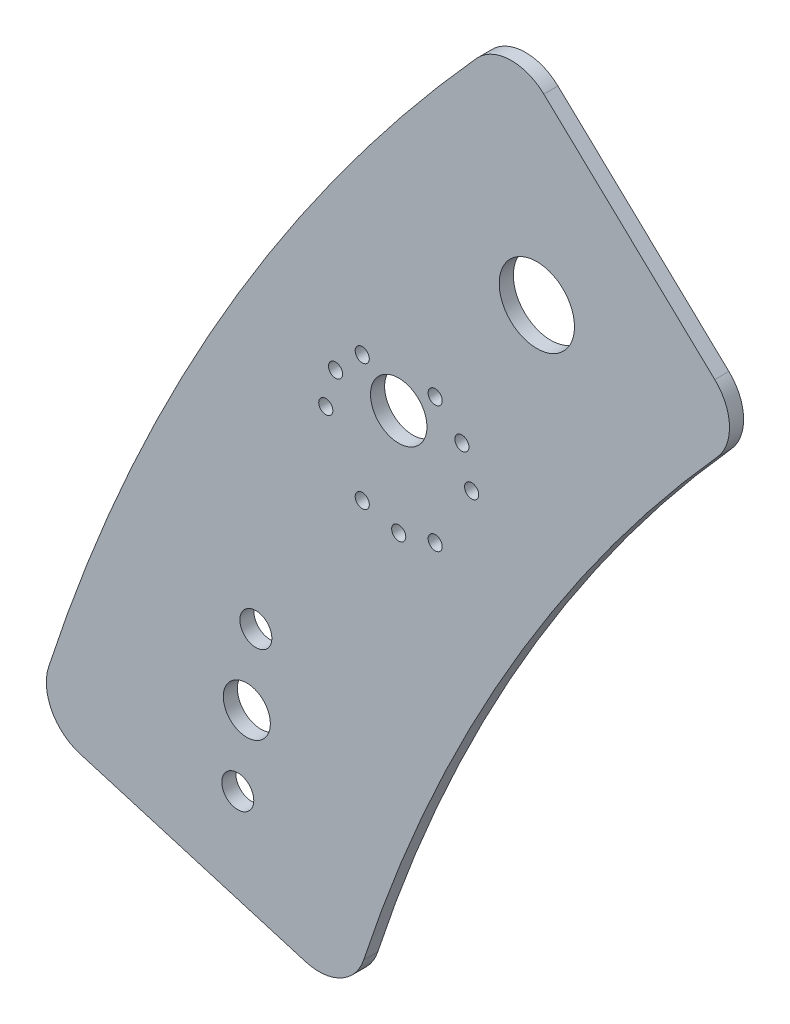
ISO-10303-21;
HEADER;
FILE_DESCRIPTION(('STEP AP214'),'2;1');
FILE_NAME('part.step','',(''),(''),'','','');
FILE_SCHEMA(('AUTOMOTIVE_DESIGN { 1 0 10303 214 1 1 1 1 }'));
ENDSEC;
DATA;
#1=APPLICATION_CONTEXT('core data for automotive mechanical design processes');
#2=APPLICATION_PROTOCOL_DEFINITION('international standard','automotive_design',2000,#1);
#3=PRODUCT_CONTEXT('',#1,'mechanical');
#4=PRODUCT('Part','Part','',(#3));
#5=PRODUCT_RELATED_PRODUCT_CATEGORY('part','',(#4));
#6=PRODUCT_DEFINITION_FORMATION('','',#4);
#7=PRODUCT_DEFINITION_CONTEXT('part definition',#1,'design');
#8=PRODUCT_DEFINITION('design','',#6,#7);
#9=PRODUCT_DEFINITION_SHAPE('','',#8);
#10=(LENGTH_UNIT() NAMED_UNIT(*) SI_UNIT(.MILLI.,.METRE.));
#11=(NAMED_UNIT(*) PLANE_ANGLE_UNIT() SI_UNIT($,.RADIAN.));
#12=(NAMED_UNIT(*) SI_UNIT($,.STERADIAN.) SOLID_ANGLE_UNIT());
#13=UNCERTAINTY_MEASURE_WITH_UNIT(LENGTH_MEASURE(1.E-05),#10,'distance_accuracy_value','');
#14=(GEOMETRIC_REPRESENTATION_CONTEXT(3) GLOBAL_UNCERTAINTY_ASSIGNED_CONTEXT((#13)) GLOBAL_UNIT_ASSIGNED_CONTEXT((#10,
#11,#12)) REPRESENTATION_CONTEXT('',''));
#15=CARTESIAN_POINT('',(0.,0.,0.));
#16=DIRECTION('',(0.,0.,1.));
#17=DIRECTION('',(1.,0.,0.));
#18=AXIS2_PLACEMENT_3D('',#15,#16,#17);
#19=CARTESIAN_POINT('',(-356.499858507935,116.702482734826,3.));
#20=DIRECTION('',(0.,0.,1.));
#21=DIRECTION('',(1.,0.,0.));
#22=AXIS2_PLACEMENT_3D('',#19,#20,#21);
#23=PLANE('',#22);
#24=CARTESIAN_POINT('',(-331.793705934377,198.005251084754,3.));
#25=DIRECTION('',(0.,0.,1.));
#26=DIRECTION('',(0.50000000000001,-0.866025403784433,0.));
#27=AXIS2_PLACEMENT_3D('',#24,#25,#26);
#28=CIRCLE('',#27,1.49999999999996);
#29=CARTESIAN_POINT('',(-331.043705934377,196.706212979078,3.));
#30=VERTEX_POINT('',#29);
#31=EDGE_CURVE('E493',#30,#30,#28,.T.);
#32=ORIENTED_EDGE('',*,*,#31,.F.);
#33=EDGE_LOOP('',(#32));
#34=FACE_BOUND('',#33,.T.);
#35=CARTESIAN_POINT('',(-347.293705934415,198.005251084752,3.));
#36=DIRECTION('',(0.,0.,1.));
#37=DIRECTION('',(-0.499999999999992,-0.866025403784443,0.));
#38=AXIS2_PLACEMENT_3D('',#35,#36,#37);
#39=CIRCLE('',#38,1.49999999999996);
#40=CARTESIAN_POINT('',(-348.043705934415,196.706212979076,3.));
#41=VERTEX_POINT('',#40);
#42=EDGE_CURVE('E492',#41,#41,#39,.T.);
#43=ORIENTED_EDGE('',*,*,#42,.F.);
#44=EDGE_LOOP('',(#43));
#45=FACE_BOUND('',#44,.T.);
#46=CARTESIAN_POINT('',(-355.043705934435,211.428644843443,3.));
#47=DIRECTION('',(0.,0.,1.));
#48=DIRECTION('',(-1.,0.,0.));
#49=AXIS2_PLACEMENT_3D('',#46,#47,#48);
#50=CIRCLE('',#49,1.49999999999996);
#51=CARTESIAN_POINT('',(-356.543705934435,211.428644843443,3.));
#52=VERTEX_POINT('',#51);
#53=EDGE_CURVE('E499',#52,#52,#50,.T.);
#54=ORIENTED_EDGE('',*,*,#53,.F.);
#55=EDGE_LOOP('',(#54));
#56=FACE_BOUND('',#55,.T.);
#57=CARTESIAN_POINT('',(-347.293705934418,224.852038602135,3.));
#58=DIRECTION('',(0.,0.,1.));
#59=DIRECTION('',(-0.500000000000004,0.866025403784436,0.));
#60=AXIS2_PLACEMENT_3D('',#57,#58,#59);
#61=CIRCLE('',#60,1.49999999999996);
#62=CARTESIAN_POINT('',(-348.043705934418,226.151076707812,3.));
#63=VERTEX_POINT('',#62);
#64=EDGE_CURVE('E505',#63,#63,#61,.T.);
#65=ORIENTED_EDGE('',*,*,#64,.F.);
#66=EDGE_LOOP('',(#65));
#67=FACE_BOUND('',#66,.T.);
#68=CARTESIAN_POINT('',(-331.79370593438,224.852038602137,3.));
#69=DIRECTION('',(0.,0.,1.));
#70=DIRECTION('',(0.499999999999998,0.86602540378444,0.));
#71=AXIS2_PLACEMENT_3D('',#68,#69,#70);
#72=CIRCLE('',#71,1.49999999999996);
#73=CARTESIAN_POINT('',(-331.04370593438,226.151076707814,3.));
#74=VERTEX_POINT('',#73);
#75=EDGE_CURVE('E485',#74,#74,#72,.T.);
#76=ORIENTED_EDGE('',*,*,#75,.F.);
#77=EDGE_LOOP('',(#76));
#78=FACE_BOUND('',#77,.T.);
#79=CARTESIAN_POINT('',(-324.04370593436,211.428644843447,3.));
#80=DIRECTION('',(0.,0.,1.));
#81=DIRECTION('',(1.,0.,0.));
#82=AXIS2_PLACEMENT_3D('',#79,#80,#81);
#83=CIRCLE('',#82,1.49999999999996);
#84=CARTESIAN_POINT('',(-322.54370593436,211.428644843447,3.));
#85=VERTEX_POINT('',#84);
#86=EDGE_CURVE('E479',#85,#85,#83,.T.);
#87=ORIENTED_EDGE('',*,*,#86,.F.);
#88=EDGE_LOOP('',(#87));
#89=FACE_BOUND('',#88,.T.);
#90=CARTESIAN_POINT('',(-339.543705934397,195.928644843445,3.));
#91=DIRECTION('',(0.,0.,1.));
#92=DIRECTION('',(1.,0.,0.));
#93=AXIS2_PLACEMENT_3D('',#90,#91,#92);
#94=CIRCLE('',#93,1.50000000000002);
#95=CARTESIAN_POINT('',(-338.043705934397,195.928644843445,3.));
#96=VERTEX_POINT('',#95);
#97=EDGE_CURVE('E462',#96,#96,#94,.T.);
#98=ORIENTED_EDGE('',*,*,#97,.F.);
#99=EDGE_LOOP('',(#98));
#100=FACE_BOUND('',#99,.T.);
#101=CARTESIAN_POINT('',(-352.967099693056,219.178644843445,3.));
#102=DIRECTION('',(0.,0.,1.));
#103=DIRECTION('',(1.,0.,0.));
#104=AXIS2_PLACEMENT_3D('',#101,#102,#103);
#105=CIRCLE('',#104,1.49999999999998);
#106=CARTESIAN_POINT('',(-351.467099693056,219.178644843445,3.));
#107=VERTEX_POINT('',#106);
#108=EDGE_CURVE('E450',#107,#107,#105,.T.);
#109=ORIENTED_EDGE('',*,*,#108,.F.);
#110=EDGE_LOOP('',(#109));
#111=FACE_BOUND('',#110,.T.);
#112=CARTESIAN_POINT('',(-371.824242114162,147.162716088828,3.));
#113=DIRECTION('',(0.,0.,1.));
#114=DIRECTION('',(1.,0.,0.));
#115=AXIS2_PLACEMENT_3D('',#112,#113,#114);
#116=CIRCLE('',#115,4.9999999999867);
#117=CARTESIAN_POINT('',(-366.824242114175,147.162716088828,3.));
#118=VERTEX_POINT('',#117);
#119=EDGE_CURVE('E438',#118,#118,#116,.T.);
#120=ORIENTED_EDGE('',*,*,#119,.F.);
#121=EDGE_LOOP('',(#120));
#122=FACE_BOUND('',#121,.T.);
#123=CARTESIAN_POINT('',(-310.189407892832,252.536198060979,3.));
#124=DIRECTION('',(0.,0.,1.));
#125=DIRECTION('',(1.,0.,0.));
#126=AXIS2_PLACEMENT_3D('',#123,#124,#125);
#127=CIRCLE('',#126,7.99999999999999);
#128=CARTESIAN_POINT('',(-302.189407892832,252.536198060979,3.));
#129=VERTEX_POINT('',#128);
#130=EDGE_CURVE('E383',#129,#129,#127,.T.);
#131=ORIENTED_EDGE('',*,*,#130,.F.);
#132=EDGE_LOOP('',(#131));
#133=FACE_BOUND('',#132,.T.);
#134=DIRECTION('',(0.958329612996936,-0.285664756057065,0.));
#135=VECTOR('',#134,1.);
#136=CARTESIAN_POINT('',(-407.288017736784,121.406904945674,3.));
#137=LINE('',#136,#135);
#138=CARTESIAN_POINT('',(-407.288017736784,121.406904945674,3.));
#139=VERTEX_POINT('',#138);
#140=CARTESIAN_POINT('',(-359.356506068505,107.119186604856,3.));
#141=VERTEX_POINT('',#140);
#142=EDGE_CURVE('E400',#139,#141,#137,.T.);
#143=ORIENTED_EDGE('',*,*,#142,.T.);
#144=CARTESIAN_POINT('',(-356.499858507935,116.702482734826,3.));
#145=DIRECTION('',(0.,0.,1.));
#146=DIRECTION('',(1.,0.,0.));
#147=AXIS2_PLACEMENT_3D('',#144,#145,#146);
#148=CIRCLE('',#147,9.99999999999996);
#149=CARTESIAN_POINT('',(-346.996122098117,113.591374531515,3.));
#150=VERTEX_POINT('',#149);
#151=EDGE_CURVE('E337',#141,#150,#148,.T.);
#152=ORIENTED_EDGE('',*,*,#151,.T.);
#153=CARTESIAN_POINT('',(0.,0.,3.));
#154=DIRECTION('',(0.,0.,1.));
#155=DIRECTION('',(1.,0.,0.));
#156=AXIS2_PLACEMENT_3D('',#153,#154,#155);
#157=CIRCLE('',#156,365.115473677973);
#158=CARTESIAN_POINT('',(-271.800817076749,243.790124811285,3.));
#159=VERTEX_POINT('',#158);
#160=EDGE_CURVE('E412',#159,#150,#157,.T.);
#161=ORIENTED_EDGE('',*,*,#160,.F.);
#162=CARTESIAN_POINT('',(-279.245059697824,250.467193913711,3.));
#163=DIRECTION('',(0.,0.,-1.));
#164=DIRECTION('',(-1.,0.,0.));
#165=AXIS2_PLACEMENT_3D('',#162,#163,#164);
#166=CIRCLE('',#165,9.99999999999999);
#167=CARTESIAN_POINT('',(-272.371911597413,257.730790487711,3.));
#168=VERTEX_POINT('',#167);
#169=EDGE_CURVE('E423',#168,#159,#166,.T.);
#170=ORIENTED_EDGE('',*,*,#169,.F.);
#171=DIRECTION('',(-0.726359657400013,0.687314810041029,0.));
#172=VECTOR('',#171,1.);
#173=CARTESIAN_POINT('',(-272.371911597413,257.730790487711,3.));
#174=LINE('',#173,#172);
#175=CARTESIAN_POINT('',(-308.701287129448,292.107311248912,3.));
#176=VERTEX_POINT('',#175);
#177=EDGE_CURVE('E360',#168,#176,#174,.T.);
#178=ORIENTED_EDGE('',*,*,#177,.T.);
#179=CARTESIAN_POINT('',(-315.574435229859,284.843714674912,3.));
#180=DIRECTION('',(0.,0.,1.));
#181=DIRECTION('',(1.,0.,0.));
#182=AXIS2_PLACEMENT_3D('',#179,#180,#181);
#183=CIRCLE('',#182,10.);
#184=CARTESIAN_POINT('',(-322.997699137418,291.544099213036,3.));
#185=VERTEX_POINT('',#184);
#186=EDGE_CURVE('E352',#176,#185,#183,.T.);
#187=ORIENTED_EDGE('',*,*,#186,.T.);
#188=CARTESIAN_POINT('',(0.,0.,3.));
#189=DIRECTION('',(0.,0.,1.));
#190=DIRECTION('',(1.,0.,0.));
#191=AXIS2_PLACEMENT_3D('',#188,#189,#190);
#192=CIRCLE('',#191,435.115473677973);
#193=CARTESIAN_POINT('',(-413.944817585624,134.071486260169,3.));
#194=VERTEX_POINT('',#193);
#195=EDGE_CURVE('E357',#185,#194,#192,.T.);
#196=ORIENTED_EDGE('',*,*,#195,.T.);
#197=CARTESIAN_POINT('',(-404.431370176213,130.990201075644,3.));
#198=DIRECTION('',(0.,0.,-1.));
#199=DIRECTION('',(-1.,0.,0.));
#200=AXIS2_PLACEMENT_3D('',#197,#198,#199);
#201=CIRCLE('',#200,9.99999999999993);
#202=EDGE_CURVE('E375',#139,#194,#201,.T.);
#203=ORIENTED_EDGE('',*,*,#202,.F.);
#204=EDGE_LOOP('',(#143,#152,#161,#170,#178,#187,#196,#203));
#205=FACE_BOUND('',#204,.T.);
#206=CARTESIAN_POINT('',(-373.746213466012,131.278572230166,3.));
#207=DIRECTION('',(0.,0.,1.));
#208=DIRECTION('',(1.,0.,0.));
#209=AXIS2_PLACEMENT_3D('',#206,#207,#208);
#210=CIRCLE('',#209,3.39999999999997);
#211=CARTESIAN_POINT('',(-370.346213466012,131.278572230166,3.));
#212=VERTEX_POINT('',#211);
#213=EDGE_CURVE('E432',#212,#212,#210,.T.);
#214=ORIENTED_EDGE('',*,*,#213,.F.);
#215=EDGE_LOOP('',(#214));
#216=FACE_BOUND('',#215,.T.);
#217=CARTESIAN_POINT('',(-369.902270762312,163.04685994749,3.));
#218=DIRECTION('',(0.,0.,1.));
#219=DIRECTION('',(1.,0.,0.));
#220=AXIS2_PLACEMENT_3D('',#217,#218,#219);
#221=CIRCLE('',#220,3.40000000000003);
#222=CARTESIAN_POINT('',(-366.502270762312,163.04685994749,3.));
#223=VERTEX_POINT('',#222);
#224=EDGE_CURVE('E444',#223,#223,#221,.T.);
#225=ORIENTED_EDGE('',*,*,#224,.F.);
#226=EDGE_LOOP('',(#225));
#227=FACE_BOUND('',#226,.T.);
#228=CARTESIAN_POINT('',(-326.120312175739,219.178644843445,3.));
#229=DIRECTION('',(0.,0.,1.));
#230=DIRECTION('',(1.,0.,0.));
#231=AXIS2_PLACEMENT_3D('',#228,#229,#230);
#232=CIRCLE('',#231,1.50000000000009);
#233=CARTESIAN_POINT('',(-324.620312175738,219.178644843445,3.));
#234=VERTEX_POINT('',#233);
#235=EDGE_CURVE('E456',#234,#234,#232,.T.);
#236=ORIENTED_EDGE('',*,*,#235,.F.);
#237=EDGE_LOOP('',(#236));
#238=FACE_BOUND('',#237,.T.);
#239=CARTESIAN_POINT('',(-339.543705934397,218.428644843445,3.));
#240=DIRECTION('',(0.,0.,1.));
#241=DIRECTION('',(1.,0.,0.));
#242=AXIS2_PLACEMENT_3D('',#239,#240,#241);
#243=CIRCLE('',#242,5.99999999999999);
#244=CARTESIAN_POINT('',(-333.543705934397,218.428644843445,3.));
#245=VERTEX_POINT('',#244);
#246=EDGE_CURVE('E468',#245,#245,#243,.T.);
#247=ORIENTED_EDGE('',*,*,#246,.F.);
#248=EDGE_LOOP('',(#247));
#249=FACE_BOUND('',#248,.T.);
#250=ADVANCED_FACE('F281',(#34,#45,#56,#67,#78,#89,#100,#111,#122,#133,#205,#216,#227,#238,
#249),#23,.T.);
#251=CARTESIAN_POINT('',(-356.499858507935,116.702482734826,0.));
#252=DIRECTION('',(0.,0.,1.));
#253=DIRECTION('',(1.,0.,0.));
#254=AXIS2_PLACEMENT_3D('',#251,#252,#253);
#255=PLANE('',#254);
#256=CARTESIAN_POINT('',(-331.793705934377,198.005251084754,0.));
#257=DIRECTION('',(0.,0.,1.));
#258=DIRECTION('',(1.,0.,0.));
#259=AXIS2_PLACEMENT_3D('',#256,#257,#258);
#260=CIRCLE('',#259,1.49999999999996);
#261=CARTESIAN_POINT('',(-330.293705934377,198.005251084754,0.));
#262=VERTEX_POINT('',#261);
#263=EDGE_CURVE('E489',#262,#262,#260,.F.);
#264=ORIENTED_EDGE('',*,*,#263,.F.);
#265=EDGE_LOOP('',(#264));
#266=FACE_BOUND('',#265,.T.);
#267=CARTESIAN_POINT('',(-347.293705934415,198.005251084752,0.));
#268=DIRECTION('',(0.,0.,1.));
#269=DIRECTION('',(1.,0.,0.));
#270=AXIS2_PLACEMENT_3D('',#267,#268,#269);
#271=CIRCLE('',#270,1.49999999999996);
#272=CARTESIAN_POINT('',(-345.793705934415,198.005251084752,0.));
#273=VERTEX_POINT('',#272);
#274=EDGE_CURVE('E496',#273,#273,#271,.F.);
#275=ORIENTED_EDGE('',*,*,#274,.F.);
#276=EDGE_LOOP('',(#275));
#277=FACE_BOUND('',#276,.T.);
#278=CARTESIAN_POINT('',(-355.043705934435,211.428644843443,0.));
#279=DIRECTION('',(0.,0.,1.));
#280=DIRECTION('',(1.,0.,0.));
#281=AXIS2_PLACEMENT_3D('',#278,#279,#280);
#282=CIRCLE('',#281,1.49999999999996);
#283=CARTESIAN_POINT('',(-353.543705934435,211.428644843443,0.));
#284=VERTEX_POINT('',#283);
#285=EDGE_CURVE('E502',#284,#284,#282,.F.);
#286=ORIENTED_EDGE('',*,*,#285,.F.);
#287=EDGE_LOOP('',(#286));
#288=FACE_BOUND('',#287,.T.);
#289=CARTESIAN_POINT('',(-347.293705934418,224.852038602135,0.));
#290=DIRECTION('',(0.,0.,1.));
#291=DIRECTION('',(1.,0.,0.));
#292=AXIS2_PLACEMENT_3D('',#289,#290,#291);
#293=CIRCLE('',#292,1.49999999999996);
#294=CARTESIAN_POINT('',(-345.793705934418,224.852038602135,0.));
#295=VERTEX_POINT('',#294);
#296=EDGE_CURVE('E488',#295,#295,#293,.F.);
#297=ORIENTED_EDGE('',*,*,#296,.F.);
#298=EDGE_LOOP('',(#297));
#299=FACE_BOUND('',#298,.T.);
#300=CARTESIAN_POINT('',(-331.79370593438,224.852038602137,0.));
#301=DIRECTION('',(0.,0.,1.));
#302=DIRECTION('',(1.,0.,0.));
#303=AXIS2_PLACEMENT_3D('',#300,#301,#302);
#304=CIRCLE('',#303,1.49999999999996);
#305=CARTESIAN_POINT('',(-330.29370593438,224.852038602137,0.));
#306=VERTEX_POINT('',#305);
#307=EDGE_CURVE('E482',#306,#306,#304,.F.);
#308=ORIENTED_EDGE('',*,*,#307,.F.);
#309=EDGE_LOOP('',(#308));
#310=FACE_BOUND('',#309,.T.);
#311=CARTESIAN_POINT('',(-324.04370593436,211.428644843447,0.));
#312=DIRECTION('',(0.,0.,1.));
#313=DIRECTION('',(1.,0.,0.));
#314=AXIS2_PLACEMENT_3D('',#311,#312,#313);
#315=CIRCLE('',#314,1.49999999999996);
#316=CARTESIAN_POINT('',(-322.54370593436,211.428644843447,0.));
#317=VERTEX_POINT('',#316);
#318=EDGE_CURVE('E474',#317,#317,#315,.F.);
#319=ORIENTED_EDGE('',*,*,#318,.F.);
#320=EDGE_LOOP('',(#319));
#321=FACE_BOUND('',#320,.T.);
#322=DIRECTION('',(0.958329612996936,-0.285664756057065,0.));
#323=VECTOR('',#322,1.);
#324=CARTESIAN_POINT('',(-407.288017736784,121.406904945674,0.));
#325=LINE('',#324,#323);
#326=CARTESIAN_POINT('',(-407.288017736784,121.406904945674,0.));
#327=VERTEX_POINT('',#326);
#328=CARTESIAN_POINT('',(-359.356506068505,107.119186604856,0.));
#329=VERTEX_POINT('',#328);
#330=EDGE_CURVE('E380',#327,#329,#325,.T.);
#331=ORIENTED_EDGE('',*,*,#330,.F.);
#332=CARTESIAN_POINT('',(-404.431370176213,130.990201075644,0.));
#333=DIRECTION('',(0.,0.,-1.));
#334=DIRECTION('',(-1.,0.,0.));
#335=AXIS2_PLACEMENT_3D('',#332,#333,#334);
#336=CIRCLE('',#335,9.99999999999993);
#337=CARTESIAN_POINT('',(-413.944817585624,134.071486260169,0.));
#338=VERTEX_POINT('',#337);
#339=EDGE_CURVE('E397',#327,#338,#336,.T.);
#340=ORIENTED_EDGE('',*,*,#339,.T.);
#341=CARTESIAN_POINT('',(0.,0.,0.));
#342=DIRECTION('',(0.,0.,1.));
#343=DIRECTION('',(1.,0.,0.));
#344=AXIS2_PLACEMENT_3D('',#341,#342,#343);
#345=CIRCLE('',#344,435.115473677972);
#346=CARTESIAN_POINT('',(-322.997699137418,291.544099213036,0.));
#347=VERTEX_POINT('',#346);
#348=EDGE_CURVE('E395',#347,#338,#345,.T.);
#349=ORIENTED_EDGE('',*,*,#348,.F.);
#350=CARTESIAN_POINT('',(-315.574435229859,284.843714674912,0.));
#351=DIRECTION('',(0.,0.,1.));
#352=DIRECTION('',(1.,0.,0.));
#353=AXIS2_PLACEMENT_3D('',#350,#351,#352);
#354=CIRCLE('',#353,10.);
#355=CARTESIAN_POINT('',(-308.701287129448,292.107311248912,0.));
#356=VERTEX_POINT('',#355);
#357=EDGE_CURVE('E370',#356,#347,#354,.T.);
#358=ORIENTED_EDGE('',*,*,#357,.F.);
#359=DIRECTION('',(-0.726359657400013,0.687314810041029,0.));
#360=VECTOR('',#359,1.);
#361=CARTESIAN_POINT('',(-272.371911597413,257.730790487711,0.));
#362=LINE('',#361,#360);
#363=CARTESIAN_POINT('',(-272.371911597413,257.730790487711,0.));
#364=VERTEX_POINT('',#363);
#365=EDGE_CURVE('E392',#364,#356,#362,.T.);
#366=ORIENTED_EDGE('',*,*,#365,.F.);
#367=CARTESIAN_POINT('',(-279.245059697824,250.467193913711,0.));
#368=DIRECTION('',(0.,0.,-1.));
#369=DIRECTION('',(-1.,0.,0.));
#370=AXIS2_PLACEMENT_3D('',#367,#368,#369);
#371=CIRCLE('',#370,9.99999999999999);
#372=CARTESIAN_POINT('',(-271.800817076749,243.790124811285,0.));
#373=VERTEX_POINT('',#372);
#374=EDGE_CURVE('E389',#364,#373,#371,.T.);
#375=ORIENTED_EDGE('',*,*,#374,.T.);
#376=CARTESIAN_POINT('',(0.,0.,0.));
#377=DIRECTION('',(0.,0.,1.));
#378=DIRECTION('',(1.,0.,0.));
#379=AXIS2_PLACEMENT_3D('',#376,#377,#378);
#380=CIRCLE('',#379,365.115473677973);
#381=CARTESIAN_POINT('',(-346.996122098117,113.591374531515,0.));
#382=VERTEX_POINT('',#381);
#383=EDGE_CURVE('E386',#373,#382,#380,.T.);
#384=ORIENTED_EDGE('',*,*,#383,.T.);
#385=CARTESIAN_POINT('',(-356.499858507935,116.702482734826,0.));
#386=DIRECTION('',(0.,0.,1.));
#387=DIRECTION('',(1.,0.,0.));
#388=AXIS2_PLACEMENT_3D('',#385,#386,#387);
#389=CIRCLE('',#388,9.99999999999996);
#390=EDGE_CURVE('E382',#329,#382,#389,.T.);
#391=ORIENTED_EDGE('',*,*,#390,.F.);
#392=EDGE_LOOP('',(#331,#340,#349,#358,#366,#375,#384,#391));
#393=FACE_BOUND('',#392,.T.);
#394=CARTESIAN_POINT('',(-310.189407892832,252.536198060979,0.));
#395=DIRECTION('',(0.,0.,1.));
#396=DIRECTION('',(1.,0.,0.));
#397=AXIS2_PLACEMENT_3D('',#394,#395,#396);
#398=CIRCLE('',#397,7.99999999999999);
#399=CARTESIAN_POINT('',(-302.189407892832,252.536198060979,0.));
#400=VERTEX_POINT('',#399);
#401=EDGE_CURVE('E429',#400,#400,#398,.T.);
#402=ORIENTED_EDGE('',*,*,#401,.T.);
#403=EDGE_LOOP('',(#402));
#404=FACE_BOUND('',#403,.T.);
#405=CARTESIAN_POINT('',(-373.746213466012,131.278572230166,0.));
#406=DIRECTION('',(0.,0.,1.));
#407=DIRECTION('',(1.,0.,0.));
#408=AXIS2_PLACEMENT_3D('',#405,#406,#407);
#409=CIRCLE('',#408,3.39999999999997);
#410=CARTESIAN_POINT('',(-370.346213466012,131.278572230166,0.));
#411=VERTEX_POINT('',#410);
#412=EDGE_CURVE('E435',#411,#411,#409,.T.);
#413=ORIENTED_EDGE('',*,*,#412,.T.);
#414=EDGE_LOOP('',(#413));
#415=FACE_BOUND('',#414,.T.);
#416=CARTESIAN_POINT('',(-371.824242114162,147.162716088828,0.));
#417=DIRECTION('',(0.,0.,1.));
#418=DIRECTION('',(1.,0.,0.));
#419=AXIS2_PLACEMENT_3D('',#416,#417,#418);
#420=CIRCLE('',#419,4.9999999999867);
#421=CARTESIAN_POINT('',(-366.824242114175,147.162716088828,0.));
#422=VERTEX_POINT('',#421);
#423=EDGE_CURVE('E441',#422,#422,#420,.T.);
#424=ORIENTED_EDGE('',*,*,#423,.T.);
#425=EDGE_LOOP('',(#424));
#426=FACE_BOUND('',#425,.T.);
#427=CARTESIAN_POINT('',(-369.902270762312,163.04685994749,0.));
#428=DIRECTION('',(0.,0.,1.));
#429=DIRECTION('',(1.,0.,0.));
#430=AXIS2_PLACEMENT_3D('',#427,#428,#429);
#431=CIRCLE('',#430,3.40000000000003);
#432=CARTESIAN_POINT('',(-366.502270762312,163.04685994749,0.));
#433=VERTEX_POINT('',#432);
#434=EDGE_CURVE('E447',#433,#433,#431,.T.);
#435=ORIENTED_EDGE('',*,*,#434,.T.);
#436=EDGE_LOOP('',(#435));
#437=FACE_BOUND('',#436,.T.);
#438=CARTESIAN_POINT('',(-352.967099693056,219.178644843445,0.));
#439=DIRECTION('',(0.,0.,1.));
#440=DIRECTION('',(1.,0.,0.));
#441=AXIS2_PLACEMENT_3D('',#438,#439,#440);
#442=CIRCLE('',#441,1.49999999999998);
#443=CARTESIAN_POINT('',(-351.467099693056,219.178644843445,0.));
#444=VERTEX_POINT('',#443);
#445=EDGE_CURVE('E453',#444,#444,#442,.T.);
#446=ORIENTED_EDGE('',*,*,#445,.T.);
#447=EDGE_LOOP('',(#446));
#448=FACE_BOUND('',#447,.T.);
#449=CARTESIAN_POINT('',(-326.120312175739,219.178644843445,0.));
#450=DIRECTION('',(0.,0.,1.));
#451=DIRECTION('',(1.,0.,0.));
#452=AXIS2_PLACEMENT_3D('',#449,#450,#451);
#453=CIRCLE('',#452,1.50000000000009);
#454=CARTESIAN_POINT('',(-324.620312175738,219.178644843445,0.));
#455=VERTEX_POINT('',#454);
#456=EDGE_CURVE('E459',#455,#455,#453,.T.);
#457=ORIENTED_EDGE('',*,*,#456,.T.);
#458=EDGE_LOOP('',(#457));
#459=FACE_BOUND('',#458,.T.);
#460=CARTESIAN_POINT('',(-339.543705934397,195.928644843445,0.));
#461=DIRECTION('',(0.,0.,1.));
#462=DIRECTION('',(1.,0.,0.));
#463=AXIS2_PLACEMENT_3D('',#460,#461,#462);
#464=CIRCLE('',#463,1.50000000000002);
#465=CARTESIAN_POINT('',(-338.043705934397,195.928644843445,0.));
#466=VERTEX_POINT('',#465);
#467=EDGE_CURVE('E465',#466,#466,#464,.T.);
#468=ORIENTED_EDGE('',*,*,#467,.T.);
#469=EDGE_LOOP('',(#468));
#470=FACE_BOUND('',#469,.T.);
#471=CARTESIAN_POINT('',(-339.543705934397,218.428644843445,0.));
#472=DIRECTION('',(0.,0.,1.));
#473=DIRECTION('',(1.,0.,0.));
#474=AXIS2_PLACEMENT_3D('',#471,#472,#473);
#475=CIRCLE('',#474,5.99999999999999);
#476=CARTESIAN_POINT('',(-333.543705934397,218.428644843445,0.));
#477=VERTEX_POINT('',#476);
#478=EDGE_CURVE('E471',#477,#477,#475,.T.);
#479=ORIENTED_EDGE('',*,*,#478,.T.);
#480=EDGE_LOOP('',(#479));
#481=FACE_BOUND('',#480,.T.);
#482=ADVANCED_FACE('F416',(#266,#277,#288,#299,#310,#321,#393,#404,#415,#426,#437,#448,#459,
#470,#481),#255,.F.);
#483=CARTESIAN_POINT('',(-407.288017736784,121.406904945674,3.));
#484=DIRECTION('',(0.285664756057065,0.958329612996936,0.));
#485=DIRECTION('',(-0.958329612996936,0.285664756057065,0.));
#486=AXIS2_PLACEMENT_3D('',#483,#484,#485);
#487=PLANE('',#486);
#488=ORIENTED_EDGE('',*,*,#330,.T.);
#489=DIRECTION('',(0.,0.,-1.));
#490=VECTOR('',#489,1.);
#491=CARTESIAN_POINT('',(-359.356506068505,107.119186604856,3.));
#492=LINE('',#491,#490);
#493=EDGE_CURVE('E12',#141,#329,#492,.T.);
#494=ORIENTED_EDGE('',*,*,#493,.F.);
#495=ORIENTED_EDGE('',*,*,#142,.F.);
#496=DIRECTION('',(0.,0.,-1.));
#497=VECTOR('',#496,1.);
#498=CARTESIAN_POINT('',(-407.288017736784,121.406904945674,3.));
#499=LINE('',#498,#497);
#500=EDGE_CURVE('E298',#139,#327,#499,.T.);
#501=ORIENTED_EDGE('',*,*,#500,.T.);
#502=EDGE_LOOP('',(#488,#494,#495,#501));
#503=FACE_BOUND('',#502,.T.);
#504=ADVANCED_FACE('F283',(#503),#487,.F.);
#505=CARTESIAN_POINT('',(-356.499858507935,116.702482734826,3.));
#506=DIRECTION('',(0.,0.,-1.));
#507=DIRECTION('',(-1.,0.,0.));
#508=AXIS2_PLACEMENT_3D('',#505,#506,#507);
#509=CYLINDRICAL_SURFACE('',#508,9.99999999999996);
#510=ORIENTED_EDGE('',*,*,#390,.T.);
#511=DIRECTION('',(0.,0.,-1.));
#512=VECTOR('',#511,1.);
#513=CARTESIAN_POINT('',(-346.996122098117,113.591374531515,3.));
#514=LINE('',#513,#512);
#515=EDGE_CURVE('E290',#150,#382,#514,.T.);
#516=ORIENTED_EDGE('',*,*,#515,.F.);
#517=ORIENTED_EDGE('',*,*,#151,.F.);
#518=ORIENTED_EDGE('',*,*,#493,.T.);
#519=EDGE_LOOP('',(#510,#516,#517,#518));
#520=FACE_BOUND('',#519,.T.);
#521=ADVANCED_FACE('F413',(#520),#509,.T.);
#522=CARTESIAN_POINT('',(0.,0.,3.));
#523=DIRECTION('',(0.,0.,-1.));
#524=DIRECTION('',(-1.,0.,0.));
#525=AXIS2_PLACEMENT_3D('',#522,#523,#524);
#526=CYLINDRICAL_SURFACE('',#525,365.115473677973);
#527=ORIENTED_EDGE('',*,*,#383,.F.);
#528=DIRECTION('',(0.,0.,-1.));
#529=VECTOR('',#528,1.);
#530=CARTESIAN_POINT('',(-271.800817076749,243.790124811285,3.));
#531=LINE('',#530,#529);
#532=EDGE_CURVE('E406',#159,#373,#531,.T.);
#533=ORIENTED_EDGE('',*,*,#532,.F.);
#534=ORIENTED_EDGE('',*,*,#160,.T.);
#535=ORIENTED_EDGE('',*,*,#515,.T.);
#536=EDGE_LOOP('',(#527,#533,#534,#535));
#537=FACE_BOUND('',#536,.T.);
#538=ADVANCED_FACE('F410',(#537),#526,.F.);
#539=CARTESIAN_POINT('',(-279.245059697824,250.467193913711,3.));
#540=DIRECTION('',(0.,0.,-1.));
#541=DIRECTION('',(-1.,0.,0.));
#542=AXIS2_PLACEMENT_3D('',#539,#540,#541);
#543=CYLINDRICAL_SURFACE('',#542,9.99999999999999);
#544=ORIENTED_EDGE('',*,*,#374,.F.);
#545=DIRECTION('',(0.,0.,-1.));
#546=VECTOR('',#545,1.);
#547=CARTESIAN_POINT('',(-272.371911597413,257.730790487711,3.));
#548=LINE('',#547,#546);
#549=EDGE_CURVE('E404',#168,#364,#548,.T.);
#550=ORIENTED_EDGE('',*,*,#549,.F.);
#551=ORIENTED_EDGE('',*,*,#169,.T.);
#552=ORIENTED_EDGE('',*,*,#532,.T.);
#553=EDGE_LOOP('',(#544,#550,#551,#552));
#554=FACE_BOUND('',#553,.T.);
#555=ADVANCED_FACE('F421',(#554),#543,.T.);
#556=CARTESIAN_POINT('',(-272.371911597413,257.730790487711,3.));
#557=DIRECTION('',(-0.687314810041029,-0.726359657400013,0.));
#558=DIRECTION('',(0.726359657400013,-0.687314810041029,0.));
#559=AXIS2_PLACEMENT_3D('',#556,#557,#558);
#560=PLANE('',#559);
#561=ORIENTED_EDGE('',*,*,#365,.T.);
#562=DIRECTION('',(0.,0.,-1.));
#563=VECTOR('',#562,1.);
#564=CARTESIAN_POINT('',(-308.701287129448,292.107311248912,3.));
#565=LINE('',#564,#563);
#566=EDGE_CURVE('E372',#176,#356,#565,.T.);
#567=ORIENTED_EDGE('',*,*,#566,.F.);
#568=ORIENTED_EDGE('',*,*,#177,.F.);
#569=ORIENTED_EDGE('',*,*,#549,.T.);
#570=EDGE_LOOP('',(#561,#567,#568,#569));
#571=FACE_BOUND('',#570,.T.);
#572=ADVANCED_FACE('F598',(#571),#560,.F.);
#573=CARTESIAN_POINT('',(-315.574435229859,284.843714674912,3.));
#574=DIRECTION('',(0.,0.,-1.));
#575=DIRECTION('',(-1.,0.,0.));
#576=AXIS2_PLACEMENT_3D('',#573,#574,#575);
#577=CYLINDRICAL_SURFACE('',#576,10.);
#578=ORIENTED_EDGE('',*,*,#357,.T.);
#579=DIRECTION('',(0.,0.,-1.));
#580=VECTOR('',#579,1.);
#581=CARTESIAN_POINT('',(-322.997699137418,291.544099213036,3.));
#582=LINE('',#581,#580);
#583=EDGE_CURVE('E367',#185,#347,#582,.T.);
#584=ORIENTED_EDGE('',*,*,#583,.F.);
#585=ORIENTED_EDGE('',*,*,#186,.F.);
#586=ORIENTED_EDGE('',*,*,#566,.T.);
#587=EDGE_LOOP('',(#578,#584,#585,#586));
#588=FACE_BOUND('',#587,.T.);
#589=ADVANCED_FACE('F368',(#588),#577,.T.);
#590=CARTESIAN_POINT('',(0.,0.,3.));
#591=DIRECTION('',(0.,0.,-1.));
#592=DIRECTION('',(-1.,0.,0.));
#593=AXIS2_PLACEMENT_3D('',#590,#591,#592);
#594=CYLINDRICAL_SURFACE('',#593,435.115473677972);
#595=ORIENTED_EDGE('',*,*,#348,.T.);
#596=DIRECTION('',(0.,0.,-1.));
#597=VECTOR('',#596,1.);
#598=CARTESIAN_POINT('',(-413.944817585624,134.071486260169,3.));
#599=LINE('',#598,#597);
#600=EDGE_CURVE('E325',#194,#338,#599,.T.);
#601=ORIENTED_EDGE('',*,*,#600,.F.);
#602=ORIENTED_EDGE('',*,*,#195,.F.);
#603=ORIENTED_EDGE('',*,*,#583,.T.);
#604=EDGE_LOOP('',(#595,#601,#602,#603));
#605=FACE_BOUND('',#604,.T.);
#606=ADVANCED_FACE('F374',(#605),#594,.T.);
#607=CARTESIAN_POINT('',(-404.431370176213,130.990201075644,3.));
#608=DIRECTION('',(0.,0.,-1.));
#609=DIRECTION('',(-1.,0.,0.));
#610=AXIS2_PLACEMENT_3D('',#607,#608,#609);
#611=CYLINDRICAL_SURFACE('',#610,9.99999999999993);
#612=ORIENTED_EDGE('',*,*,#339,.F.);
#613=ORIENTED_EDGE('',*,*,#500,.F.);
#614=ORIENTED_EDGE('',*,*,#202,.T.);
#615=ORIENTED_EDGE('',*,*,#600,.T.);
#616=EDGE_LOOP('',(#612,#613,#614,#615));
#617=FACE_BOUND('',#616,.T.);
#618=ADVANCED_FACE('F535',(#617),#611,.T.);
#619=CARTESIAN_POINT('',(-310.189407892832,252.536198060979,3.));
#620=DIRECTION('',(0.,0.,-1.));
#621=DIRECTION('',(-1.,0.,0.));
#622=AXIS2_PLACEMENT_3D('',#619,#620,#621);
#623=CYLINDRICAL_SURFACE('',#622,7.99999999999999);
#624=ORIENTED_EDGE('',*,*,#130,.T.);
#625=EDGE_LOOP('',(#624));
#626=FACE_BOUND('',#625,.T.);
#627=ORIENTED_EDGE('',*,*,#401,.F.);
#628=EDGE_LOOP('',(#627));
#629=FACE_BOUND('',#628,.T.);
#630=ADVANCED_FACE('F531',(#626,#629),#623,.F.);
#631=CARTESIAN_POINT('',(-373.746213466012,131.278572230166,3.));
#632=DIRECTION('',(0.,0.,-1.));
#633=DIRECTION('',(-1.,0.,0.));
#634=AXIS2_PLACEMENT_3D('',#631,#632,#633);
#635=CYLINDRICAL_SURFACE('',#634,3.39999999999997);
#636=ORIENTED_EDGE('',*,*,#213,.T.);
#637=EDGE_LOOP('',(#636));
#638=FACE_BOUND('',#637,.T.);
#639=ORIENTED_EDGE('',*,*,#412,.F.);
#640=EDGE_LOOP('',(#639));
#641=FACE_BOUND('',#640,.T.);
#642=ADVANCED_FACE('F534',(#638,#641),#635,.F.);
#643=CARTESIAN_POINT('',(-371.824242114162,147.162716088828,3.));
#644=DIRECTION('',(0.,0.,-1.));
#645=DIRECTION('',(-1.,0.,0.));
#646=AXIS2_PLACEMENT_3D('',#643,#644,#645);
#647=CYLINDRICAL_SURFACE('',#646,4.9999999999867);
#648=ORIENTED_EDGE('',*,*,#119,.T.);
#649=EDGE_LOOP('',(#648));
#650=FACE_BOUND('',#649,.T.);
#651=ORIENTED_EDGE('',*,*,#423,.F.);
#652=EDGE_LOOP('',(#651));
#653=FACE_BOUND('',#652,.T.);
#654=ADVANCED_FACE('F584',(#650,#653),#647,.F.);
#655=CARTESIAN_POINT('',(-369.902270762312,163.04685994749,3.));
#656=DIRECTION('',(0.,0.,-1.));
#657=DIRECTION('',(-1.,0.,0.));
#658=AXIS2_PLACEMENT_3D('',#655,#656,#657);
#659=CYLINDRICAL_SURFACE('',#658,3.40000000000003);
#660=ORIENTED_EDGE('',*,*,#224,.T.);
#661=EDGE_LOOP('',(#660));
#662=FACE_BOUND('',#661,.T.);
#663=ORIENTED_EDGE('',*,*,#434,.F.);
#664=EDGE_LOOP('',(#663));
#665=FACE_BOUND('',#664,.T.);
#666=ADVANCED_FACE('F580',(#662,#665),#659,.F.);
#667=CARTESIAN_POINT('',(-352.967099693056,219.178644843445,3.));
#668=DIRECTION('',(0.,0.,-1.));
#669=DIRECTION('',(-1.,0.,0.));
#670=AXIS2_PLACEMENT_3D('',#667,#668,#669);
#671=CYLINDRICAL_SURFACE('',#670,1.49999999999998);
#672=ORIENTED_EDGE('',*,*,#108,.T.);
#673=EDGE_LOOP('',(#672));
#674=FACE_BOUND('',#673,.T.);
#675=ORIENTED_EDGE('',*,*,#445,.F.);
#676=EDGE_LOOP('',(#675));
#677=FACE_BOUND('',#676,.T.);
#678=ADVANCED_FACE('F576',(#674,#677),#671,.F.);
#679=CARTESIAN_POINT('',(-326.120312175739,219.178644843445,3.));
#680=DIRECTION('',(0.,0.,-1.));
#681=DIRECTION('',(-1.,0.,0.));
#682=AXIS2_PLACEMENT_3D('',#679,#680,#681);
#683=CYLINDRICAL_SURFACE('',#682,1.50000000000009);
#684=ORIENTED_EDGE('',*,*,#235,.T.);
#685=EDGE_LOOP('',(#684));
#686=FACE_BOUND('',#685,.T.);
#687=ORIENTED_EDGE('',*,*,#456,.F.);
#688=EDGE_LOOP('',(#687));
#689=FACE_BOUND('',#688,.T.);
#690=ADVANCED_FACE('F569',(#686,#689),#683,.F.);
#691=CARTESIAN_POINT('',(-339.543705934397,195.928644843445,3.));
#692=DIRECTION('',(0.,0.,-1.));
#693=DIRECTION('',(-1.,0.,0.));
#694=AXIS2_PLACEMENT_3D('',#691,#692,#693);
#695=CYLINDRICAL_SURFACE('',#694,1.50000000000002);
#696=ORIENTED_EDGE('',*,*,#97,.T.);
#697=EDGE_LOOP('',(#696));
#698=FACE_BOUND('',#697,.T.);
#699=ORIENTED_EDGE('',*,*,#467,.F.);
#700=EDGE_LOOP('',(#699));
#701=FACE_BOUND('',#700,.T.);
#702=ADVANCED_FACE('F559',(#698,#701),#695,.F.);
#703=CARTESIAN_POINT('',(-339.543705934397,218.428644843445,3.));
#704=DIRECTION('',(0.,0.,-1.));
#705=DIRECTION('',(-1.,0.,0.));
#706=AXIS2_PLACEMENT_3D('',#703,#704,#705);
#707=CYLINDRICAL_SURFACE('',#706,5.99999999999999);
#708=ORIENTED_EDGE('',*,*,#246,.T.);
#709=EDGE_LOOP('',(#708));
#710=FACE_BOUND('',#709,.T.);
#711=ORIENTED_EDGE('',*,*,#478,.F.);
#712=EDGE_LOOP('',(#711));
#713=FACE_BOUND('',#712,.T.);
#714=ADVANCED_FACE('F556',(#710,#713),#707,.F.);
#715=CARTESIAN_POINT('',(-324.04370593436,211.428644843447,-4.24264068711917));
#716=DIRECTION('',(0.,0.,1.));
#717=DIRECTION('',(1.,0.,0.));
#718=AXIS2_PLACEMENT_3D('',#715,#716,#717);
#719=CYLINDRICAL_SURFACE('',#718,1.49999999999996);
#720=ORIENTED_EDGE('',*,*,#318,.T.);
#721=EDGE_LOOP('',(#720));
#722=FACE_BOUND('',#721,.T.);
#723=ORIENTED_EDGE('',*,*,#86,.T.);
#724=EDGE_LOOP('',(#723));
#725=FACE_BOUND('',#724,.T.);
#726=ADVANCED_FACE('F558',(#722,#725),#719,.F.);
#727=CARTESIAN_POINT('',(-331.79370593438,224.852038602137,-4.24264068711917));
#728=DIRECTION('',(0.,0.,1.));
#729=DIRECTION('',(0.,-1.,0.));
#730=AXIS2_PLACEMENT_3D('',#727,#728,#729);
#731=CYLINDRICAL_SURFACE('',#730,1.49999999999996);
#732=ORIENTED_EDGE('',*,*,#307,.T.);
#733=EDGE_LOOP('',(#732));
#734=FACE_BOUND('',#733,.T.);
#735=ORIENTED_EDGE('',*,*,#75,.T.);
#736=EDGE_LOOP('',(#735));
#737=FACE_BOUND('',#736,.T.);
#738=ADVANCED_FACE('F566',(#734,#737),#731,.F.);
#739=CARTESIAN_POINT('',(-347.293705934418,224.852038602135,-4.24264068711917));
#740=DIRECTION('',(0.,0.,1.));
#741=DIRECTION('',(0.,-1.,0.));
#742=AXIS2_PLACEMENT_3D('',#739,#740,#741);
#743=CYLINDRICAL_SURFACE('',#742,1.49999999999996);
#744=ORIENTED_EDGE('',*,*,#296,.T.);
#745=EDGE_LOOP('',(#744));
#746=FACE_BOUND('',#745,.T.);
#747=ORIENTED_EDGE('',*,*,#64,.T.);
#748=EDGE_LOOP('',(#747));
#749=FACE_BOUND('',#748,.T.);
#750=ADVANCED_FACE('F513',(#746,#749),#743,.F.);
#751=CARTESIAN_POINT('',(-355.043705934435,211.428644843443,-4.24264068711917));
#752=DIRECTION('',(0.,0.,1.));
#753=DIRECTION('',(1.,0.,0.));
#754=AXIS2_PLACEMENT_3D('',#751,#752,#753);
#755=CYLINDRICAL_SURFACE('',#754,1.49999999999996);
#756=ORIENTED_EDGE('',*,*,#285,.T.);
#757=EDGE_LOOP('',(#756));
#758=FACE_BOUND('',#757,.T.);
#759=ORIENTED_EDGE('',*,*,#53,.T.);
#760=EDGE_LOOP('',(#759));
#761=FACE_BOUND('',#760,.T.);
#762=ADVANCED_FACE('F729',(#758,#761),#755,.F.);
#763=CARTESIAN_POINT('',(-347.293705934415,198.005251084752,-4.24264068711917));
#764=DIRECTION('',(0.,0.,1.));
#765=DIRECTION('',(1.,0.,0.));
#766=AXIS2_PLACEMENT_3D('',#763,#764,#765);
#767=CYLINDRICAL_SURFACE('',#766,1.49999999999996);
#768=ORIENTED_EDGE('',*,*,#274,.T.);
#769=EDGE_LOOP('',(#768));
#770=FACE_BOUND('',#769,.T.);
#771=ORIENTED_EDGE('',*,*,#42,.T.);
#772=EDGE_LOOP('',(#771));
#773=FACE_BOUND('',#772,.T.);
#774=ADVANCED_FACE('F739',(#770,#773),#767,.F.);
#775=CARTESIAN_POINT('',(-331.793705934377,198.005251084754,-4.24264068711917));
#776=DIRECTION('',(0.,0.,1.));
#777=DIRECTION('',(1.,0.,0.));
#778=AXIS2_PLACEMENT_3D('',#775,#776,#777);
#779=CYLINDRICAL_SURFACE('',#778,1.49999999999996);
#780=ORIENTED_EDGE('',*,*,#263,.T.);
#781=EDGE_LOOP('',(#780));
#782=FACE_BOUND('',#781,.T.);
#783=ORIENTED_EDGE('',*,*,#31,.T.);
#784=EDGE_LOOP('',(#783));
#785=FACE_BOUND('',#784,.T.);
#786=ADVANCED_FACE('F749',(#782,#785),#779,.F.);
#787=CLOSED_SHELL('',(#250,#482,#504,#521,#538,#555,#572,#589,#606,#618,#630,#642,#654,#666,
#678,#690,#702,#714,#726,#738,#750,#762,#774,#786));
#788=MANIFOLD_SOLID_BREP('B2',#787);
#789=ADVANCED_BREP_SHAPE_REPRESENTATION('',(#18,#788),#14);
#790=SHAPE_DEFINITION_REPRESENTATION(#9,#789);
ENDSEC;
END-ISO-10303-21;
